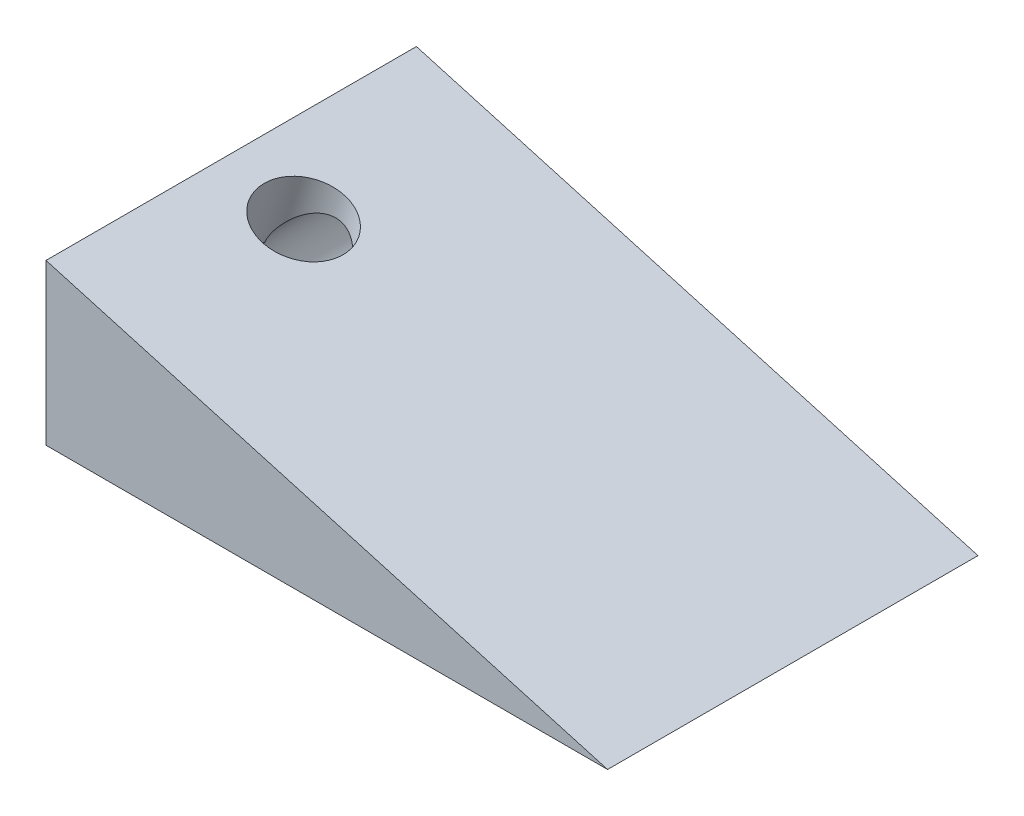
ISO-10303-21;
HEADER;
FILE_DESCRIPTION(('STEP AP214'),'2;1');
FILE_NAME('part.step','',(''),(''),'','','');
FILE_SCHEMA(('AUTOMOTIVE_DESIGN { 1 0 10303 214 1 1 1 1 }'));
ENDSEC;
DATA;
#1=APPLICATION_CONTEXT('core data for automotive mechanical design processes');
#2=APPLICATION_PROTOCOL_DEFINITION('international standard','automotive_design',2000,#1);
#3=PRODUCT_CONTEXT('',#1,'mechanical');
#4=PRODUCT('Part','Part','',(#3));
#5=PRODUCT_RELATED_PRODUCT_CATEGORY('part','',(#4));
#6=PRODUCT_DEFINITION_FORMATION('','',#4);
#7=PRODUCT_DEFINITION_CONTEXT('part definition',#1,'design');
#8=PRODUCT_DEFINITION('design','',#6,#7);
#9=PRODUCT_DEFINITION_SHAPE('','',#8);
#10=(LENGTH_UNIT() NAMED_UNIT(*) SI_UNIT(.MILLI.,.METRE.));
#11=(NAMED_UNIT(*) PLANE_ANGLE_UNIT() SI_UNIT($,.RADIAN.));
#12=(NAMED_UNIT(*) SI_UNIT($,.STERADIAN.) SOLID_ANGLE_UNIT());
#13=UNCERTAINTY_MEASURE_WITH_UNIT(LENGTH_MEASURE(1.E-05),#10,'distance_accuracy_value','');
#14=(GEOMETRIC_REPRESENTATION_CONTEXT(3) GLOBAL_UNCERTAINTY_ASSIGNED_CONTEXT((#13)) GLOBAL_UNIT_ASSIGNED_CONTEXT((#10,
#11,#12)) REPRESENTATION_CONTEXT('',''));
#15=CARTESIAN_POINT('',(0.,0.,0.));
#16=DIRECTION('',(0.,0.,1.));
#17=DIRECTION('',(1.,0.,0.));
#18=AXIS2_PLACEMENT_3D('',#15,#16,#17);
#19=CARTESIAN_POINT('',(-34.6669322262818,13.8531499753177,35.));
#20=DIRECTION('',(0.27416740056488,0.961681983021153,0.));
#21=DIRECTION('',(-0.961681983021153,0.27416740056488,0.));
#22=AXIS2_PLACEMENT_3D('',#19,#20,#21);
#23=PLANE('',#22);
#24=CARTESIAN_POINT('',(-34.6669322262818,13.8531499753177,35.));
#25=DIRECTION('',(0.27416740056488,0.961681983021153,0.));
#26=DIRECTION('',(-0.961681983021153,0.27416740056488,0.));
#27=AXIS2_PLACEMENT_3D('',#24,#25,#26);
#28=CIRCLE('',#27,7.74726566461757);
#29=CARTESIAN_POINT('',(-40.3579550502015,15.4756124543253,39.9999999999999));
#30=VERTEX_POINT('',#29);
#31=CARTESIAN_POINT('',(-28.9759094023621,12.23068749631,39.9999999999999));
#32=VERTEX_POINT('',#31);
#33=EDGE_CURVE('E119',#30,#32,#28,.T.);
#34=ORIENTED_EDGE('',*,*,#33,.T.);
#35=DIRECTION('',(-0.961681983021153,0.27416740056488,0.));
#36=VECTOR('',#35,1.);
#37=CARTESIAN_POINT('',(-34.6669322262818,13.8531499753177,39.9999999999999));
#38=LINE('',#37,#36);
#39=EDGE_CURVE('E45',#32,#30,#38,.T.);
#40=ORIENTED_EDGE('',*,*,#39,.T.);
#41=EDGE_LOOP('',(#34,#40));
#42=FACE_BOUND('',#41,.T.);
#43=ADVANCED_FACE('F37',(#42),#23,.T.);
#44=CARTESIAN_POINT('',(-44.7800669578334,30.2543014363874,70.));
#45=DIRECTION('',(1.,0.,0.));
#46=DIRECTION('',(0.,0.,-1.));
#47=AXIS2_PLACEMENT_3D('',#44,#45,#46);
#48=PLANE('',#47);
#49=DIRECTION('',(0.,-1.,0.));
#50=VECTOR('',#49,1.);
#51=CARTESIAN_POINT('',(-44.7800669578334,30.2543014363874,0.));
#52=LINE('',#51,#50);
#53=CARTESIAN_POINT('',(-44.7800669578334,30.2543014363874,0.));
#54=VERTEX_POINT('',#53);
#55=CARTESIAN_POINT('',(-44.7800669578334,0.,0.));
#56=VERTEX_POINT('',#55);
#57=EDGE_CURVE('E157',#54,#56,#52,.T.);
#58=ORIENTED_EDGE('',*,*,#57,.T.);
#59=DIRECTION('',(0.,0.,-1.));
#60=VECTOR('',#59,1.);
#61=CARTESIAN_POINT('',(-44.7800669578334,0.,70.));
#62=LINE('',#61,#60);
#63=CARTESIAN_POINT('',(-44.7800669578334,0.,70.));
#64=VERTEX_POINT('',#63);
#65=EDGE_CURVE('E176',#64,#56,#62,.T.);
#66=ORIENTED_EDGE('',*,*,#65,.F.);
#67=DIRECTION('',(0.,-1.,0.));
#68=VECTOR('',#67,1.);
#69=CARTESIAN_POINT('',(-44.7800669578334,30.2543014363874,70.));
#70=LINE('',#69,#68);
#71=CARTESIAN_POINT('',(-44.7800669578334,30.2543014363874,70.));
#72=VERTEX_POINT('',#71);
#73=EDGE_CURVE('E166',#72,#64,#70,.T.);
#74=ORIENTED_EDGE('',*,*,#73,.F.);
#75=DIRECTION('',(0.,0.,-1.));
#76=VECTOR('',#75,1.);
#77=CARTESIAN_POINT('',(-44.7800669578334,30.2543014363874,70.));
#78=LINE('',#77,#76);
#79=EDGE_CURVE('E169',#72,#54,#78,.T.);
#80=ORIENTED_EDGE('',*,*,#79,.T.);
#81=EDGE_LOOP('',(#58,#66,#74,#80));
#82=FACE_BOUND('',#81,.T.);
#83=ADVANCED_FACE('F39',(#82),#48,.F.);
#84=CARTESIAN_POINT('',(-44.7800669578334,0.,70.));
#85=DIRECTION('',(0.,1.,0.));
#86=DIRECTION('',(0.,0.,1.));
#87=AXIS2_PLACEMENT_3D('',#84,#85,#86);
#88=PLANE('',#87);
#89=DIRECTION('',(1.,0.,0.));
#90=VECTOR('',#89,1.);
#91=CARTESIAN_POINT('',(-44.7800669578334,0.,0.));
#92=LINE('',#91,#90);
#93=CARTESIAN_POINT('',(61.3412900682718,0.,0.));
#94=VERTEX_POINT('',#93);
#95=EDGE_CURVE('E160',#56,#94,#92,.T.);
#96=ORIENTED_EDGE('',*,*,#95,.T.);
#97=DIRECTION('',(0.,0.,-1.));
#98=VECTOR('',#97,1.);
#99=CARTESIAN_POINT('',(61.3412900682718,0.,70.));
#100=LINE('',#99,#98);
#101=CARTESIAN_POINT('',(61.3412900682718,0.,70.));
#102=VERTEX_POINT('',#101);
#103=EDGE_CURVE('E174',#102,#94,#100,.T.);
#104=ORIENTED_EDGE('',*,*,#103,.F.);
#105=DIRECTION('',(1.,0.,0.));
#106=VECTOR('',#105,1.);
#107=CARTESIAN_POINT('',(-44.7800669578334,0.,70.));
#108=LINE('',#107,#106);
#109=EDGE_CURVE('E84',#64,#102,#108,.T.);
#110=ORIENTED_EDGE('',*,*,#109,.F.);
#111=ORIENTED_EDGE('',*,*,#65,.T.);
#112=EDGE_LOOP('',(#96,#104,#110,#111));
#113=FACE_BOUND('',#112,.T.);
#114=ADVANCED_FACE('F155',(#113),#88,.F.);
#115=CARTESIAN_POINT('',(61.3412900682718,0.,70.));
#116=DIRECTION('',(-0.27416740056488,-0.961681983021153,0.));
#117=DIRECTION('',(0.961681983021153,-0.27416740056488,0.));
#118=AXIS2_PLACEMENT_3D('',#115,#116,#117);
#119=PLANE('',#118);
#120=CARTESIAN_POINT('',(-31.1027560189384,26.3550157545926,35.));
#121=DIRECTION('',(0.27416740056488,0.961681983021153,0.));
#122=DIRECTION('',(-0.961681983021153,0.27416740056488,0.));
#123=AXIS2_PLACEMENT_3D('',#120,#121,#122);
#124=CIRCLE('',#123,7.74726566461757);
#125=CARTESIAN_POINT('',(-38.5531618262795,28.4790634433463,35.));
#126=VERTEX_POINT('',#125);
#127=EDGE_CURVE('E162',#126,#126,#124,.T.);
#128=ORIENTED_EDGE('',*,*,#127,.F.);
#129=EDGE_LOOP('',(#128));
#130=FACE_BOUND('',#129,.T.);
#131=DIRECTION('',(-0.961681983021153,0.27416740056488,0.));
#132=VECTOR('',#131,1.);
#133=CARTESIAN_POINT('',(61.3412900682718,0.,0.));
#134=LINE('',#133,#132);
#135=EDGE_CURVE('E78',#94,#54,#134,.T.);
#136=ORIENTED_EDGE('',*,*,#135,.T.);
#137=ORIENTED_EDGE('',*,*,#79,.F.);
#138=DIRECTION('',(-0.961681983021153,0.27416740056488,0.));
#139=VECTOR('',#138,1.);
#140=CARTESIAN_POINT('',(61.3412900682718,0.,70.));
#141=LINE('',#140,#139);
#142=EDGE_CURVE('E61',#102,#72,#141,.T.);
#143=ORIENTED_EDGE('',*,*,#142,.F.);
#144=ORIENTED_EDGE('',*,*,#103,.T.);
#145=EDGE_LOOP('',(#136,#137,#143,#144));
#146=FACE_BOUND('',#145,.T.);
#147=ADVANCED_FACE('F188',(#130,#146),#119,.F.);
#148=CARTESIAN_POINT('',(0.,0.,70.));
#149=DIRECTION('',(0.,0.,1.));
#150=DIRECTION('',(1.,0.,0.));
#151=AXIS2_PLACEMENT_3D('',#148,#149,#150);
#152=PLANE('',#151);
#153=ORIENTED_EDGE('',*,*,#73,.T.);
#154=ORIENTED_EDGE('',*,*,#109,.T.);
#155=ORIENTED_EDGE('',*,*,#142,.T.);
#156=EDGE_LOOP('',(#153,#154,#155));
#157=FACE_BOUND('',#156,.T.);
#158=ADVANCED_FACE('F182',(#157),#152,.T.);
#159=CARTESIAN_POINT('',(0.,0.,0.));
#160=DIRECTION('',(0.,0.,1.));
#161=DIRECTION('',(1.,0.,0.));
#162=AXIS2_PLACEMENT_3D('',#159,#160,#161);
#163=PLANE('',#162);
#164=CARTESIAN_POINT('',(-33.2041702327617,13.1411771219608,0.));
#165=DIRECTION('',(0.,0.,-1.));
#166=DIRECTION('',(-1.,0.,0.));
#167=AXIS2_PLACEMENT_3D('',#164,#165,#166);
#168=CIRCLE('',#167,8.71569370718466);
#169=CARTESIAN_POINT('',(-41.9198639399463,13.1411771219608,0.));
#170=VERTEX_POINT('',#169);
#171=EDGE_CURVE('E113',#170,#170,#168,.T.);
#172=ORIENTED_EDGE('',*,*,#171,.F.);
#173=EDGE_LOOP('',(#172));
#174=FACE_BOUND('',#173,.T.);
#175=ORIENTED_EDGE('',*,*,#57,.F.);
#176=ORIENTED_EDGE('',*,*,#135,.F.);
#177=ORIENTED_EDGE('',*,*,#95,.F.);
#178=EDGE_LOOP('',(#175,#176,#177));
#179=FACE_BOUND('',#178,.T.);
#180=ADVANCED_FACE('F149',(#174,#179),#163,.F.);
#181=CARTESIAN_POINT('',(-34.6669322262818,13.8531499753177,35.));
#182=DIRECTION('',(0.274167400564879,0.961681983021153,0.));
#183=DIRECTION('',(-0.961681983021153,0.27416740056488,0.));
#184=AXIS2_PLACEMENT_3D('',#181,#182,#183);
#185=CYLINDRICAL_SURFACE('',#184,7.74726566461757);
#186=DIRECTION('',(0.274167400564879,0.961681983021153,0.));
#187=VECTOR('',#186,1.);
#188=CARTESIAN_POINT('',(-40.3579550502015,15.4756124543253,39.9999999999999));
#189=LINE('',#188,#187);
#190=CARTESIAN_POINT('',(-39.2275944047125,19.4405166144963,39.9999999999999));
#191=VERTEX_POINT('',#190);
#192=EDGE_CURVE('E52',#191,#30,#189,.F.);
#193=ORIENTED_EDGE('',*,*,#192,.F.);
#194=CARTESIAN_POINT('',(-39.2275944047125,19.4405166144963,39.9999999999999));
#195=CARTESIAN_POINT('',(-39.3000640386581,19.3712178055316,39.940003629128));
#196=CARTESIAN_POINT('',(-39.37130753756,19.3007046891593,39.8799415059002));
#197=CARTESIAN_POINT('',(-39.5113741863794,19.1572020006421,39.7599471452604));
#198=CARTESIAN_POINT('',(-39.5801972646603,19.0842123553256,39.7000149117419));
#199=CARTESIAN_POINT('',(-39.7834303119285,18.8610756767847,39.5204987971171));
#200=CARTESIAN_POINT('',(-39.9142262121663,18.7071220029388,39.4015113259474));
#201=CARTESIAN_POINT('',(-40.1707469857107,18.3827775676807,39.1638436873589));
#202=CARTESIAN_POINT('',(-40.2961309481094,18.2119988386682,39.0453219797893));
#203=CARTESIAN_POINT('',(-40.5365240719253,17.8577154547906,38.8177024840035));
#204=CARTESIAN_POINT('',(-40.6515462208113,17.6742272552331,38.7085929061422));
#205=CARTESIAN_POINT('',(-40.8816993021898,17.2736305674725,38.4966571246178));
#206=CARTESIAN_POINT('',(-40.9957653320188,17.0549867637482,38.3954586248919));
#207=CARTESIAN_POINT('',(-41.1550680512018,16.7135827043791,38.2694176923764));
#208=CARTESIAN_POINT('',(-41.2059674128283,16.5981782830085,38.231827192663));
#209=CARTESIAN_POINT('',(-41.3035905114414,16.3628033383035,38.1671076295487));
#210=CARTESIAN_POINT('',(-41.3503181843717,16.2428372745622,38.1399686234044));
#211=CARTESIAN_POINT('',(-41.4328393482783,16.0160483250767,38.1008800693142));
#212=CARTESIAN_POINT('',(-41.4692496513014,15.9097185002213,38.0873427463683));
#213=CARTESIAN_POINT('',(-41.5036883436374,15.8022513269962,38.0789438109275));
#214=B_SPLINE_CURVE_WITH_KNOTS('',3,(#194,#195,#196,#197,#198,#199,#200,#201,#202,#203,#204,
#205,#206,#207,#208,#209,#210,#211,#212,#213),.UNSPECIFIED.,.F.,.F.,(4,2,2,2,2,2,2,2,2,4),(0.,
0.350521611191314,0.70105358795834,1.40394662718883,2.13159869728888,2.85832565770624,
3.65532260352624,4.04972519312957,4.44375164623477,4.78296753227657),.UNSPECIFIED.);
#215=CARTESIAN_POINT('',(-41.5036883436374,15.8022513269962,38.0789438109275));
#216=VERTEX_POINT('',#215);
#217=EDGE_CURVE('E100',#191,#216,#214,.T.);
#218=ORIENTED_EDGE('',*,*,#217,.T.);
#219=CARTESIAN_POINT('',(-41.5036883436374,15.8022513269962,31.9210561890725));
#220=VERTEX_POINT('',#219);
#221=EDGE_CURVE('E158',#220,#216,#28,.T.);
#222=ORIENTED_EDGE('',*,*,#221,.F.);
#223=CARTESIAN_POINT('',(-41.5036883436374,15.8022513269962,31.9210561890725));
#224=CARTESIAN_POINT('',(-41.4604465270726,15.9372156132852,31.9105545686971));
#225=CARTESIAN_POINT('',(-41.4141233187346,16.0702769724111,31.8919052711745));
#226=CARTESIAN_POINT('',(-41.3162963358022,16.3311458108692,31.8408682903675));
#227=CARTESIAN_POINT('',(-41.264815816026,16.45897351127,31.8085403305278));
#228=CARTESIAN_POINT('',(-41.1580943558264,16.707189745186,31.7331526347921));
#229=CARTESIAN_POINT('',(-41.1029232332954,16.8276623280973,31.6902651730426));
#230=CARTESIAN_POINT('',(-40.9885637821229,17.0633830959653,31.5959312733278));
#231=CARTESIAN_POINT('',(-40.929370362401,17.178624339978,31.5444738641376));
#232=CARTESIAN_POINT('',(-40.7629577934145,17.4859571753384,31.3954033473787));
#233=CARTESIAN_POINT('',(-40.652116687233,17.672993201039,31.291437287921));
#234=CARTESIAN_POINT('',(-40.4202968942204,18.0337032928818,31.0724113340332));
#235=CARTESIAN_POINT('',(-40.2993129077991,18.2073702817401,30.957345635324));
#236=CARTESIAN_POINT('',(-40.0460161651936,18.5446362929047,30.7199760653806));
#237=CARTESIAN_POINT('',(-39.9135990482682,18.7081124026828,30.597609567722));
#238=CARTESIAN_POINT('',(-39.6384635809363,19.0239507844109,30.350321414532));
#239=CARTESIAN_POINT('',(-39.4957478228675,19.1763158339171,30.2254004076471));
#240=CARTESIAN_POINT('',(-39.1808666547818,19.4892298226419,29.9595764840067));
#241=CARTESIAN_POINT('',(-39.0072680206548,19.648338353324,29.8186702306537));
#242=CARTESIAN_POINT('',(-38.6463536350692,19.9530593303597,29.5397529166275));
#243=CARTESIAN_POINT('',(-38.459035432446,20.0986693544637,29.4017423790023));
#244=CARTESIAN_POINT('',(-38.0712655800465,20.3752028925122,29.1317656943468));
#245=CARTESIAN_POINT('',(-37.8708726163113,20.5061857237275,28.9997765219293));
#246=CARTESIAN_POINT('',(-37.4562444754121,20.7531071493502,28.7437301002613));
#247=CARTESIAN_POINT('',(-37.2420074518678,20.8690437308125,28.6196739134399));
#248=CARTESIAN_POINT('',(-36.67452340318,21.1454265893272,28.3147873291146));
#249=CARTESIAN_POINT('',(-36.311102523818,21.2940303073989,28.141462711161));
#250=CARTESIAN_POINT('',(-35.7432242653044,21.4812210997383,27.909237916214));
#251=CARTESIAN_POINT('',(-35.5501037456016,21.5376724732524,27.8364461287223));
#252=CARTESIAN_POINT('',(-35.1568608109256,21.637730581741,27.701569159265));
#253=CARTESIAN_POINT('',(-34.956739619019,21.6813395479595,27.6394821182312));
#254=CARTESIAN_POINT('',(-34.5848625973967,21.7485259238907,27.5370417384535));
#255=CARTESIAN_POINT('',(-34.4140126620102,21.7742409806412,27.4947889882425));
#256=CARTESIAN_POINT('',(-34.069066694925,21.8155892701688,27.4196804025821));
#257=CARTESIAN_POINT('',(-33.8949713318398,21.8312245564405,27.3868226539016));
#258=CARTESIAN_POINT('',(-33.5446109417526,21.8519862047222,27.3313644338203));
#259=CARTESIAN_POINT('',(-33.3683470760786,21.8571179647481,27.3087586983144));
#260=CARTESIAN_POINT('',(-33.0147538986269,21.8566054209785,27.2745346002894));
#261=CARTESIAN_POINT('',(-32.837424577759,21.8509610251115,27.2629163316482));
#262=CARTESIAN_POINT('',(-32.4821779044824,21.8287469694903,27.2512450223458));
#263=CARTESIAN_POINT('',(-32.3042619688023,21.8121235315287,27.2512493384958));
#264=CARTESIAN_POINT('',(-31.9501882426331,21.7680347338047,27.2633786606713));
#265=CARTESIAN_POINT('',(-31.7740304583397,21.7405693358491,27.2755037093951));
#266=CARTESIAN_POINT('',(-31.4249703601949,21.6751852202019,27.3120470090886));
#267=CARTESIAN_POINT('',(-31.2520678782915,21.637267043715,27.3364646236505));
#268=CARTESIAN_POINT('',(-30.9109279971018,21.5516041833462,27.3975201176758));
#269=CARTESIAN_POINT('',(-30.7426903939791,21.5038599295942,27.4341574622724));
#270=CARTESIAN_POINT('',(-30.4250821602671,21.4034724214764,27.5160129117543));
#271=CARTESIAN_POINT('',(-30.2752651244979,21.3515045332889,27.560335611614));
#272=CARTESIAN_POINT('',(-29.9814445508125,21.2406843454175,27.6587453465511));
#273=CARTESIAN_POINT('',(-29.8374429759254,21.1818297468004,27.7128356455572));
#274=CARTESIAN_POINT('',(-29.5560112733931,21.0581132425431,27.8302832297053));
#275=CARTESIAN_POINT('',(-29.4185794888441,20.993252863812,27.8936381617673));
#276=CARTESIAN_POINT('',(-29.1506915936652,20.8583742727903,28.0291192641885));
#277=CARTESIAN_POINT('',(-29.0202382052626,20.7883540726476,28.1012488220635));
#278=CARTESIAN_POINT('',(-28.7567925810447,20.6384344173794,28.2596706307998));
#279=CARTESIAN_POINT('',(-28.62439650096,20.5581904130512,28.3466288183201));
#280=CARTESIAN_POINT('',(-28.3683824469127,20.3938764566017,28.5294149140085));
#281=CARTESIAN_POINT('',(-28.2447675172835,20.3098051940247,28.6252458720074));
#282=CARTESIAN_POINT('',(-27.8872155140591,20.0534260071129,28.9251624801135));
#283=CARTESIAN_POINT('',(-27.6664962908032,19.8769089513487,29.1417175104412));
#284=CARTESIAN_POINT('',(-27.3422105599064,19.5930632461546,29.5104018578262));
#285=CARTESIAN_POINT('',(-27.2272395962139,19.4864730314465,29.6533944787366));
#286=CARTESIAN_POINT('',(-27.0095499049623,19.2741268553411,29.949026053497));
#287=CARTESIAN_POINT('',(-26.9068295302025,19.1683707835756,30.1016637062549));
#288=CARTESIAN_POINT('',(-26.7132714180974,18.9594128445064,30.4162540392341));
#289=CARTESIAN_POINT('',(-26.6224476719356,18.8562140983488,30.5782173705783));
#290=CARTESIAN_POINT('',(-26.4525439687437,18.6544559724556,30.9109487563636));
#291=CARTESIAN_POINT('',(-26.3734630533686,18.5558962145761,31.0817160907666));
#292=CARTESIAN_POINT('',(-26.2311187105981,18.3711544518526,31.4215474167212));
#293=CARTESIAN_POINT('',(-26.1672005478652,18.2845856385394,31.5901265145856));
#294=CARTESIAN_POINT('',(-26.0494687139218,18.1195142868216,31.9346463455846));
#295=CARTESIAN_POINT('',(-25.9956555183071,18.0410121281573,32.1105874247386));
#296=CARTESIAN_POINT('',(-25.8982046105746,17.8944829390763,32.4691733968861));
#297=CARTESIAN_POINT('',(-25.8545498296007,17.8264384033562,32.6518064389504));
#298=CARTESIAN_POINT('',(-25.7773885412956,17.703142902154,33.0234096451435));
#299=CARTESIAN_POINT('',(-25.7438781171061,17.6478870007717,33.212377332006));
#300=CARTESIAN_POINT('',(-25.6927786526345,17.5620691782673,33.5575582030909));
#301=CARTESIAN_POINT('',(-25.6733493435062,17.5287824349665,33.7128231948285));
#302=CARTESIAN_POINT('',(-25.6411938551619,17.4731217553039,34.0259150635794));
#303=CARTESIAN_POINT('',(-25.6284638381533,17.4507415714965,34.18374042031));
#304=CARTESIAN_POINT('',(-25.6097811429993,17.4177334599664,34.5008715597988));
#305=CARTESIAN_POINT('',(-25.6038220127977,17.4070943443226,34.6601757871028));
#306=CARTESIAN_POINT('',(-25.5987028326565,17.3979612636029,34.9792480198922));
#307=CARTESIAN_POINT('',(-25.5995428925896,17.3994674947917,35.1390160328306));
#308=CARTESIAN_POINT('',(-25.6080129731764,17.414558024137,35.4576776512378));
#309=CARTESIAN_POINT('',(-25.6156380922015,17.4281336032088,35.6165718046343));
#310=CARTESIAN_POINT('',(-25.6376166524641,17.4668070114999,35.9324667882811));
#311=CARTESIAN_POINT('',(-25.6519701458994,17.4919049301076,36.0894676038334));
#312=CARTESIAN_POINT('',(-25.6873533920353,17.5527547187872,36.4009134358126));
#313=CARTESIAN_POINT('',(-25.7083954318887,17.5885261891687,36.5553531936852));
#314=CARTESIAN_POINT('',(-25.7570595399659,17.6695419716592,36.8606832438898));
#315=CARTESIAN_POINT('',(-25.7846833427702,17.7147887805505,37.0115725889961));
#316=CARTESIAN_POINT('',(-25.8579380683695,17.831866583706,37.364713317688));
#317=CARTESIAN_POINT('',(-25.906444190478,17.907323357556,37.5651726389679));
#318=CARTESIAN_POINT('',(-26.0155981864407,18.0704130284645,37.9575552332209));
#319=CARTESIAN_POINT('',(-26.0762454015217,18.1580452648057,38.149478968643));
#320=CARTESIAN_POINT('',(-26.2097447365001,18.3425519013947,38.5244672781329));
#321=CARTESIAN_POINT('',(-26.282600143105,18.4394287874689,38.7075294493254));
#322=CARTESIAN_POINT('',(-26.4406389910728,18.6397429853818,39.0643735474969));
#323=CARTESIAN_POINT('',(-26.525816171386,18.7431769504732,39.2381601266435));
#324=CARTESIAN_POINT('',(-26.6727576039574,18.9127582401491,39.5096746718535));
#325=CARTESIAN_POINT('',(-26.7305455832512,18.9775616733347,39.610421871684));
#326=CARTESIAN_POINT('',(-26.8506571195599,19.1080888917221,39.808046858785));
#327=CARTESIAN_POINT('',(-26.9129674049797,19.1738095604445,39.9049347713582));
#328=CARTESIAN_POINT('',(-26.9776558684195,19.2398520327999,39.9999999999999));
#329=B_SPLINE_CURVE_WITH_KNOTS('',3,(#223,#224,#225,#226,#227,#228,#229,#230,#231,#232,#233,
#234,#235,#236,#237,#238,#239,#240,#241,#242,#243,#244,#245,#246,#247,#248,#249,#250,#251,#252,
#253,#254,#255,#256,#257,#258,#259,#260,#261,#262,#263,#264,#265,#266,#267,#268,#269,#270,#271,
#272,#273,#274,#275,#276,#277,#278,#279,#280,#281,#282,#283,#284,#285,#286,#287,#288,#289,#290,
#291,#292,#293,#294,#295,#296,#297,#298,#299,#300,#301,#302,#303,#304,#305,#306,#307,#308,#309,
#310,#311,#312,#313,#314,#315,#316,#317,#318,#319,#320,#321,#322,#323,#324,#325,#326,#327,#328),
.UNSPECIFIED.,.F.,.F.,(4,2,2,2,2,2,2,2,2,2,2,2,2,2,2,2,2,2,2,2,2,2,2,2,2,2,2,2,2,2,2,2,2,2,2,2,
2,2,2,2,2,2,2,2,2,2,2,2,2,2,2,2,4),(0.,0.425671288113467,0.849502892955172,1.26683142327134,
1.68469838220909,2.4064348878333,3.12855087487262,3.85814633417994,4.58755877863971,
5.41013689540505,6.23286233574533,7.05211995346039,7.87148706186767,9.15361353784701,
9.79490642744951,10.4360878328044,10.9691716693981,11.502146869485,12.0348480918852,
12.5675538656978,13.1028885177524,13.6382250556622,14.1735338811024,14.7088192787408,
15.2022325138787,15.6958109334992,16.1892642085249,16.6829085933952,17.215071299981,
17.7474176103996,18.8118187116767,19.4479458425142,20.0839873437424,20.7207702791262,
21.3575012173883,21.9569788414435,22.5564846731772,23.1549757812332,23.7532355090612,
24.2326811270005,24.7118517873334,25.1905654564573,25.669286861448,26.1476627114135,
26.6260422726025,27.1053057668567,27.5846957078525,28.2425608419285,28.9003902900375,
29.5583971253465,30.2160707751821,30.6149463172899,31.0126952489692),.UNSPECIFIED.);
#330=CARTESIAN_POINT('',(-26.9776558684195,19.2398520327999,39.9999999999999));
#331=VERTEX_POINT('',#330);
#332=EDGE_CURVE('E108',#220,#331,#329,.T.);
#333=ORIENTED_EDGE('',*,*,#332,.T.);
#334=DIRECTION('',(0.274167400564879,0.961681983021153,0.));
#335=VECTOR('',#334,1.);
#336=CARTESIAN_POINT('',(-28.9759094023621,12.23068749631,39.9999999999999));
#337=LINE('',#336,#335);
#338=EDGE_CURVE('E112',#32,#331,#337,.T.);
#339=ORIENTED_EDGE('',*,*,#338,.F.);
#340=ORIENTED_EDGE('',*,*,#33,.F.);
#341=EDGE_LOOP('',(#193,#218,#222,#333,#339,#340));
#342=FACE_BOUND('',#341,.T.);
#343=ORIENTED_EDGE('',*,*,#127,.T.);
#344=EDGE_LOOP('',(#343));
#345=FACE_BOUND('',#344,.T.);
#346=ADVANCED_FACE('F116',(#342,#345),#185,.F.);
#347=DIRECTION('',(0.,0.,-1.));
#348=VECTOR('',#347,1.);
#349=CARTESIAN_POINT('',(-41.5036883436374,15.8022513269962,39.9999999999999));
#350=LINE('',#349,#348);
#351=EDGE_CURVE('E11',#220,#216,#350,.F.);
#352=ORIENTED_EDGE('',*,*,#351,.F.);
#353=ORIENTED_EDGE('',*,*,#221,.T.);
#354=EDGE_LOOP('',(#352,#353));
#355=FACE_BOUND('',#354,.T.);
#356=ADVANCED_FACE('F141',(#355),#23,.T.);
#357=CARTESIAN_POINT('',(-33.2041702327617,13.1411771219608,39.9999999999999));
#358=DIRECTION('',(0.,0.,-1.));
#359=DIRECTION('',(-1.,0.,0.));
#360=AXIS2_PLACEMENT_3D('',#357,#358,#359);
#361=CYLINDRICAL_SURFACE('',#360,8.71569370718466);
#362=ORIENTED_EDGE('',*,*,#171,.T.);
#363=EDGE_LOOP('',(#362));
#364=FACE_BOUND('',#363,.T.);
#365=ORIENTED_EDGE('',*,*,#351,.T.);
#366=ORIENTED_EDGE('',*,*,#217,.F.);
#367=CARTESIAN_POINT('',(-33.2041702327617,13.1411771219608,39.9999999999999));
#368=DIRECTION('',(0.,0.,-1.));
#369=DIRECTION('',(-1.,0.,0.));
#370=AXIS2_PLACEMENT_3D('',#367,#368,#369);
#371=CIRCLE('',#370,8.71569370718466);
#372=EDGE_CURVE('E102',#331,#191,#371,.T.);
#373=ORIENTED_EDGE('',*,*,#372,.F.);
#374=ORIENTED_EDGE('',*,*,#332,.F.);
#375=EDGE_LOOP('',(#365,#366,#373,#374));
#376=FACE_BOUND('',#375,.T.);
#377=ADVANCED_FACE('F101',(#364,#376),#361,.F.);
#378=CARTESIAN_POINT('',(-33.2041702327617,13.1411771219608,39.9999999999999));
#379=DIRECTION('',(0.,0.,-1.));
#380=DIRECTION('',(-1.,0.,0.));
#381=AXIS2_PLACEMENT_3D('',#378,#379,#380);
#382=PLANE('',#381);
#383=ORIENTED_EDGE('',*,*,#192,.T.);
#384=ORIENTED_EDGE('',*,*,#39,.F.);
#385=ORIENTED_EDGE('',*,*,#338,.T.);
#386=ORIENTED_EDGE('',*,*,#372,.T.);
#387=EDGE_LOOP('',(#383,#384,#385,#386));
#388=FACE_BOUND('',#387,.T.);
#389=ADVANCED_FACE('F110',(#388),#382,.T.);
#390=CLOSED_SHELL('',(#43,#83,#114,#147,#158,#180,#346,#356,#377,#389));
#391=MANIFOLD_SOLID_BREP('B2',#390);
#392=ADVANCED_BREP_SHAPE_REPRESENTATION('',(#18,#391),#14);
#393=SHAPE_DEFINITION_REPRESENTATION(#9,#392);
ENDSEC;
END-ISO-10303-21;
